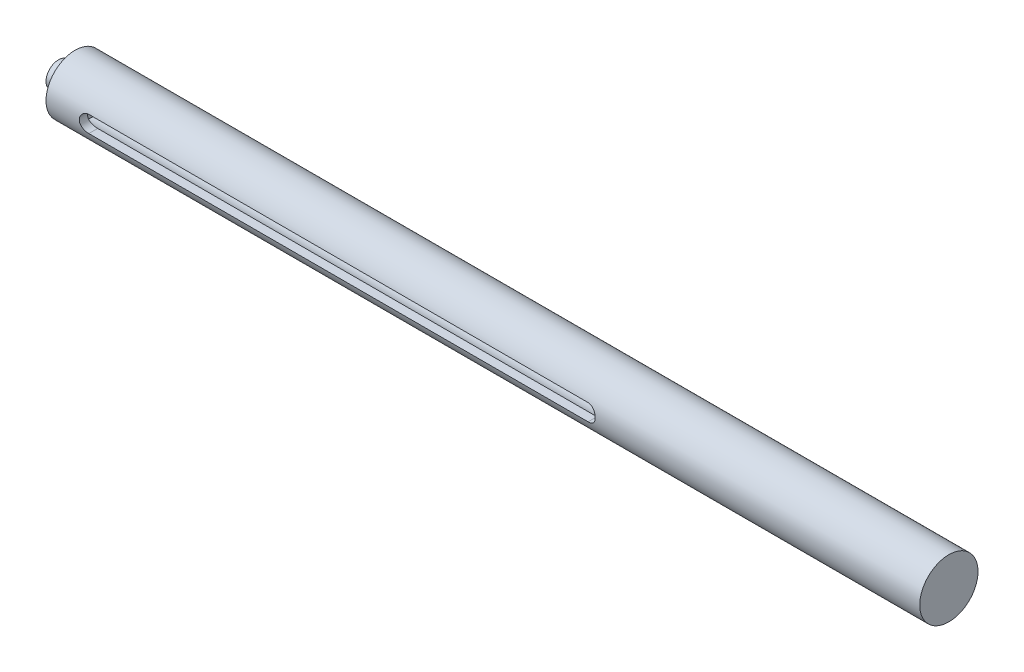
ISO-10303-21;
HEADER;
FILE_DESCRIPTION(('STEP AP214'),'2;1');
FILE_NAME('part.step','',(''),(''),'','','');
FILE_SCHEMA(('AUTOMOTIVE_DESIGN { 1 0 10303 214 1 1 1 1 }'));
ENDSEC;
DATA;
#1=APPLICATION_CONTEXT('core data for automotive mechanical design processes');
#2=APPLICATION_PROTOCOL_DEFINITION('international standard','automotive_design',2000,#1);
#3=PRODUCT_CONTEXT('',#1,'mechanical');
#4=PRODUCT('Part','Part','',(#3));
#5=PRODUCT_RELATED_PRODUCT_CATEGORY('part','',(#4));
#6=PRODUCT_DEFINITION_FORMATION('','',#4);
#7=PRODUCT_DEFINITION_CONTEXT('part definition',#1,'design');
#8=PRODUCT_DEFINITION('design','',#6,#7);
#9=PRODUCT_DEFINITION_SHAPE('','',#8);
#10=(LENGTH_UNIT() NAMED_UNIT(*) SI_UNIT(.MILLI.,.METRE.));
#11=(NAMED_UNIT(*) PLANE_ANGLE_UNIT() SI_UNIT($,.RADIAN.));
#12=(NAMED_UNIT(*) SI_UNIT($,.STERADIAN.) SOLID_ANGLE_UNIT());
#13=UNCERTAINTY_MEASURE_WITH_UNIT(LENGTH_MEASURE(1.E-05),#10,'distance_accuracy_value','');
#14=(GEOMETRIC_REPRESENTATION_CONTEXT(3) GLOBAL_UNCERTAINTY_ASSIGNED_CONTEXT((#13)) GLOBAL_UNIT_ASSIGNED_CONTEXT((#10,
#11,#12)) REPRESENTATION_CONTEXT('',''));
#15=CARTESIAN_POINT('',(0.,0.,0.));
#16=DIRECTION('',(0.,0.,1.));
#17=DIRECTION('',(1.,0.,0.));
#18=AXIS2_PLACEMENT_3D('',#15,#16,#17);
#19=CARTESIAN_POINT('',(-40.,0.,0.));
#20=DIRECTION('',(1.,0.,0.));
#21=DIRECTION('',(0.,0.,-1.));
#22=AXIS2_PLACEMENT_3D('',#19,#20,#21);
#23=PLANE('',#22);
#24=CARTESIAN_POINT('',(-40.,0.,0.));
#25=DIRECTION('',(1.,0.,0.));
#26=DIRECTION('',(0.,0.,-1.));
#27=AXIS2_PLACEMENT_3D('',#24,#25,#26);
#28=CIRCLE('',#27,3.5);
#29=CARTESIAN_POINT('',(-40.,0.,-3.5));
#30=VERTEX_POINT('',#29);
#31=EDGE_CURVE('E87',#30,#30,#28,.T.);
#32=ORIENTED_EDGE('',*,*,#31,.F.);
#33=EDGE_LOOP('',(#32));
#34=FACE_BOUND('',#33,.T.);
#35=CARTESIAN_POINT('',(-40.,0.,0.));
#36=DIRECTION('',(1.,0.,0.));
#37=DIRECTION('',(0.,0.,-1.));
#38=AXIS2_PLACEMENT_3D('',#35,#36,#37);
#39=CIRCLE('',#38,1.5);
#40=CARTESIAN_POINT('',(-40.,0.,-1.5));
#41=VERTEX_POINT('',#40);
#42=EDGE_CURVE('E27',#41,#41,#39,.F.);
#43=ORIENTED_EDGE('',*,*,#42,.F.);
#44=EDGE_LOOP('',(#43));
#45=FACE_BOUND('',#44,.T.);
#46=ADVANCED_FACE('F18',(#34,#45),#23,.F.);
#47=CARTESIAN_POINT('',(40.,0.,0.));
#48=DIRECTION('',(-1.,0.,0.));
#49=DIRECTION('',(0.,0.,1.));
#50=AXIS2_PLACEMENT_3D('',#47,#48,#49);
#51=CYLINDRICAL_SURFACE('',#50,3.5);
#52=ORIENTED_EDGE('',*,*,#31,.T.);
#53=EDGE_LOOP('',(#52));
#54=FACE_BOUND('',#53,.T.);
#55=CARTESIAN_POINT('',(25.,-1.,3.35410196624968));
#56=CARTESIAN_POINT('',(25.0275170249075,-1.00000049850503,3.35409976658492));
#57=CARTESIAN_POINT('',(25.0550202597348,-0.998863493287081,3.35444102034788));
#58=CARTESIAN_POINT('',(25.1098181033841,-0.994332009888001,3.35578786459359));
#59=CARTESIAN_POINT('',(25.1371127542802,-0.990937999820865,3.3567933173179));
#60=CARTESIAN_POINT('',(25.2182537496955,-0.977425314705552,3.36076375039943));
#61=CARTESIAN_POINT('',(25.2715378170372,-0.963975716618306,3.36468309657148));
#62=CARTESIAN_POINT('',(25.3749700144545,-0.928648815906224,3.37460265056326));
#63=CARTESIAN_POINT('',(25.4251189911293,-0.906773800005599,3.38060229373009));
#64=CARTESIAN_POINT('',(25.5210683200399,-0.855250482454159,3.39400252324997));
#65=CARTESIAN_POINT('',(25.5668668974157,-0.825599026596321,3.40140367773159));
#66=CARTESIAN_POINT('',(25.6540953815059,-0.758463189713919,3.41700871116802));
#67=CARTESIAN_POINT('',(25.6953820675198,-0.72079643428964,3.42522837538694));
#68=CARTESIAN_POINT('',(25.7711495263556,-0.639087782954267,3.44140944203543));
#69=CARTESIAN_POINT('',(25.8056291705064,-0.595044831905348,3.44937080145308));
#70=CARTESIAN_POINT('',(25.8674150706982,-0.500821950623903,3.46431682750159));
#71=CARTESIAN_POINT('',(25.8945760360545,-0.450543143150311,3.47128058280447));
#72=CARTESIAN_POINT('',(25.940001691248,-0.345901809951461,3.48326292773679));
#73=CARTESIAN_POINT('',(25.9582685086114,-0.291540264432993,3.48828198248995));
#74=CARTESIAN_POINT('',(25.9849170938375,-0.18177986422046,3.49569755735467));
#75=CARTESIAN_POINT('',(25.9935443291132,-0.126445076386653,3.49815908311015));
#76=CARTESIAN_POINT('',(26.0014433806286,-0.0150612429205636,3.50041048233729));
#77=CARTESIAN_POINT('',(26.0007167870587,0.0409876796872728,3.50020080992396));
#78=CARTESIAN_POINT('',(25.9900967865968,0.150490378802964,3.49718002611497));
#79=CARTESIAN_POINT('',(25.9804690968915,0.203972329131895,3.4944443251868));
#80=CARTESIAN_POINT('',(25.9527522573653,0.308526642102498,3.48676938053403));
#81=CARTESIAN_POINT('',(25.9346626803645,0.359598882951953,3.48183002556336));
#82=CARTESIAN_POINT('',(25.8903451327296,0.458537318553558,3.47019511125505));
#83=CARTESIAN_POINT('',(25.8640302352287,0.506362294335579,3.46348091788377));
#84=CARTESIAN_POINT('',(25.8040771088532,0.597004321590961,3.44901371958343));
#85=CARTESIAN_POINT('',(25.770437393581,0.639820353903323,3.44126050393247));
#86=CARTESIAN_POINT('',(25.695401201975,0.720812145758809,3.42522923719649));
#87=CARTESIAN_POINT('',(25.6537744565459,0.758773058684968,3.41694231453104));
#88=CARTESIAN_POINT('',(25.5646513518634,0.827240355260741,3.40101643089073));
#89=CARTESIAN_POINT('',(25.5171533336562,0.857744624720446,3.39337765408524));
#90=CARTESIAN_POINT('',(25.4171063869067,0.910632887034017,3.37957156162494));
#91=CARTESIAN_POINT('',(25.3645179481512,0.932945634858352,3.37341730876614));
#92=CARTESIAN_POINT('',(25.2561439679439,0.968311532076212,3.36343812734786));
#93=CARTESIAN_POINT('',(25.2003634116952,0.981378715751668,3.3596096696078));
#94=CARTESIAN_POINT('',(25.1200602690921,0.993060108315531,3.35616467475823));
#95=CARTESIAN_POINT('',(25.0961103225751,0.995662513879,3.35539270208153));
#96=CARTESIAN_POINT('',(25.0481108873562,0.999130770524189,3.35436137521794));
#97=CARTESIAN_POINT('',(25.0240616067922,0.999999270178643,3.35410123920007));
#98=CARTESIAN_POINT('',(25.,1.,3.35410196624968));
#99=B_SPLINE_CURVE_WITH_KNOTS('',3,(#55,#56,#57,#58,#59,#60,#61,#62,#63,#64,#65,#66,#67,#68,#69,
#70,#71,#72,#73,#74,#75,#76,#77,#78,#79,#80,#81,#82,#83,#84,#85,#86,#87,#88,#89,#90,#91,#92,#93,
#94,#95,#96,#97,#98),.UNSPECIFIED.,.F.,.F.,(4,2,2,2,2,2,2,2,2,2,2,2,2,2,2,2,2,2,2,2,2,4),(0.,
0.0824984357609059,0.164979766271595,0.329407523681618,0.493790685524924,0.658240626330376,
0.826933952896786,0.995655226942842,1.16751346138032,1.33933056621707,1.50666495361948,
1.67397089384628,1.83643825095359,1.99891381075498,2.16316806750177,2.32745568686297,
2.49749310251654,2.6675786732818,2.83911034045408,3.01038106966817,3.08263487199162,
3.15477822061624),.UNSPECIFIED.);
#100=CARTESIAN_POINT('',(25.,-1.,3.35410196624968));
#101=VERTEX_POINT('',#100);
#102=CARTESIAN_POINT('',(25.,1.,3.35410196624968));
#103=VERTEX_POINT('',#102);
#104=EDGE_CURVE('E90',#101,#103,#99,.T.);
#105=ORIENTED_EDGE('',*,*,#104,.F.);
#106=DIRECTION('',(-1.,0.,0.));
#107=VECTOR('',#106,1.);
#108=CARTESIAN_POINT('',(40.,-1.,3.35410196624968));
#109=LINE('',#108,#107);
#110=CARTESIAN_POINT('',(-35.,-1.,3.35410196624968));
#111=VERTEX_POINT('',#110);
#112=EDGE_CURVE('E152',#111,#101,#109,.F.);
#113=ORIENTED_EDGE('',*,*,#112,.F.);
#114=CARTESIAN_POINT('',(-35.,1.,3.35410196624968));
#115=CARTESIAN_POINT('',(-35.0275170249075,1.00000049850503,3.35409976658492));
#116=CARTESIAN_POINT('',(-35.0550202597348,0.998863493287082,3.35444102034788));
#117=CARTESIAN_POINT('',(-35.1098181033841,0.994332009888001,3.35578786459359));
#118=CARTESIAN_POINT('',(-35.1371127542802,0.990937999820865,3.3567933173179));
#119=CARTESIAN_POINT('',(-35.2182537496955,0.977425314705554,3.36076375039943));
#120=CARTESIAN_POINT('',(-35.2715378170372,0.963975716618308,3.36468309657148));
#121=CARTESIAN_POINT('',(-35.3749700144545,0.928648815906219,3.37460265056326));
#122=CARTESIAN_POINT('',(-35.4251189911293,0.906773800005585,3.38060229373009));
#123=CARTESIAN_POINT('',(-35.52106832004,0.855250482454147,3.39400252324997));
#124=CARTESIAN_POINT('',(-35.5668668974158,0.825599026596321,3.40140367773159));
#125=CARTESIAN_POINT('',(-35.6540953815059,0.75846318971392,3.41700871116802));
#126=CARTESIAN_POINT('',(-35.6953820675198,0.720796434289633,3.42522837538694));
#127=CARTESIAN_POINT('',(-35.7711495263556,0.639087782954258,3.44140944203543));
#128=CARTESIAN_POINT('',(-35.8056291705064,0.595044831905346,3.44937080145308));
#129=CARTESIAN_POINT('',(-35.8674150706982,0.500821950623907,3.46431682750159));
#130=CARTESIAN_POINT('',(-35.8945760360545,0.450543143150314,3.47128058280446));
#131=CARTESIAN_POINT('',(-35.940001691248,0.345901809951462,3.48326292773679));
#132=CARTESIAN_POINT('',(-35.9582685086114,0.291540264432993,3.48828198248995));
#133=CARTESIAN_POINT('',(-35.9849170938375,0.181779864220459,3.49569755735467));
#134=CARTESIAN_POINT('',(-35.9935443291132,0.126445076386652,3.49815908311015));
#135=CARTESIAN_POINT('',(-36.0014433806286,0.0150612429205627,3.50041048233729));
#136=CARTESIAN_POINT('',(-36.0007167870587,-0.0409876796872739,3.50020080992396));
#137=CARTESIAN_POINT('',(-35.9900967865968,-0.150490378802965,3.49718002611497));
#138=CARTESIAN_POINT('',(-35.9804690968915,-0.203972329131895,3.4944443251868));
#139=CARTESIAN_POINT('',(-35.9527522573653,-0.308526642102499,3.48676938053403));
#140=CARTESIAN_POINT('',(-35.9346626803645,-0.359598882951955,3.48183002556336));
#141=CARTESIAN_POINT('',(-35.8903451327296,-0.458537318553552,3.47019511125505));
#142=CARTESIAN_POINT('',(-35.8640302352286,-0.506362294335566,3.46348091788377));
#143=CARTESIAN_POINT('',(-35.8040771088533,-0.597004321590951,3.44901371958344));
#144=CARTESIAN_POINT('',(-35.7704373935811,-0.639820353903326,3.44126050393247));
#145=CARTESIAN_POINT('',(-35.695401201975,-0.720812145758812,3.42522923719649));
#146=CARTESIAN_POINT('',(-35.6537744565459,-0.758773058684957,3.41694231453104));
#147=CARTESIAN_POINT('',(-35.5646513518634,-0.827240355260727,3.40101643089074));
#148=CARTESIAN_POINT('',(-35.5171533336562,-0.857744624720442,3.39337765408524));
#149=CARTESIAN_POINT('',(-35.4171063869067,-0.910632887034021,3.37957156162494));
#150=CARTESIAN_POINT('',(-35.3645179481512,-0.932945634858353,3.37341730876614));
#151=CARTESIAN_POINT('',(-35.2561439679439,-0.968311532076213,3.36343812734786));
#152=CARTESIAN_POINT('',(-35.2003634116952,-0.981378715751669,3.3596096696078));
#153=CARTESIAN_POINT('',(-35.1200602690921,-0.993060108315532,3.35616467475823));
#154=CARTESIAN_POINT('',(-35.0961103225751,-0.995662513879001,3.35539270208153));
#155=CARTESIAN_POINT('',(-35.0481108873562,-0.999130770524188,3.35436137521794));
#156=CARTESIAN_POINT('',(-35.0240616067922,-0.999999270178643,3.35410123920007));
#157=CARTESIAN_POINT('',(-35.,-1.,3.35410196624968));
#158=B_SPLINE_CURVE_WITH_KNOTS('',3,(#114,#115,#116,#117,#118,#119,#120,#121,#122,#123,#124,
#125,#126,#127,#128,#129,#130,#131,#132,#133,#134,#135,#136,#137,#138,#139,#140,#141,#142,#143,
#144,#145,#146,#147,#148,#149,#150,#151,#152,#153,#154,#155,#156,#157),.UNSPECIFIED.,.F.,.F.,(4,
2,2,2,2,2,2,2,2,2,2,2,2,2,2,2,2,2,2,2,2,4),(0.,0.0824984357609093,0.164979766271588,
0.329407523681618,0.493790685524952,0.658240626330415,0.826933952896799,0.99565522694284,
1.16751346138032,1.33933056621707,1.50666495361948,1.67397089384628,1.8364382509536,
1.99891381075499,2.16316806750176,2.32745568686294,2.49749310251653,2.66757867328181,
2.83911034045409,3.01038106966818,3.08263487199164,3.15477822061625),.UNSPECIFIED.);
#159=CARTESIAN_POINT('',(-35.,1.,3.35410196624968));
#160=VERTEX_POINT('',#159);
#161=EDGE_CURVE('E97',#160,#111,#158,.T.);
#162=ORIENTED_EDGE('',*,*,#161,.F.);
#163=DIRECTION('',(-1.,0.,0.));
#164=VECTOR('',#163,1.);
#165=CARTESIAN_POINT('',(40.,1.,3.35410196624968));
#166=LINE('',#165,#164);
#167=EDGE_CURVE('E75',#103,#160,#166,.T.);
#168=ORIENTED_EDGE('',*,*,#167,.F.);
#169=EDGE_LOOP('',(#105,#113,#162,#168));
#170=FACE_BOUND('',#169,.T.);
#171=CARTESIAN_POINT('',(65.,0.,0.));
#172=DIRECTION('',(1.,0.,0.));
#173=DIRECTION('',(0.,0.,-1.));
#174=AXIS2_PLACEMENT_3D('',#171,#172,#173);
#175=CIRCLE('',#174,3.5);
#176=CARTESIAN_POINT('',(65.,0.,-3.5));
#177=VERTEX_POINT('',#176);
#178=EDGE_CURVE('E70',#177,#177,#175,.T.);
#179=ORIENTED_EDGE('',*,*,#178,.F.);
#180=EDGE_LOOP('',(#179));
#181=FACE_BOUND('',#180,.T.);
#182=ADVANCED_FACE('F20',(#54,#170,#181),#51,.T.);
#183=CARTESIAN_POINT('',(-35.,0.,3.5));
#184=DIRECTION('',(0.,0.,-1.));
#185=DIRECTION('',(-1.,0.,0.));
#186=AXIS2_PLACEMENT_3D('',#183,#184,#185);
#187=CYLINDRICAL_SURFACE('',#186,1.);
#188=CARTESIAN_POINT('',(-35.,1.,2.29128784747792));
#189=CARTESIAN_POINT('',(-35.0269103840027,1.00000116386643,2.29128430939571));
#190=CARTESIAN_POINT('',(-35.0538065609444,0.998913043941582,2.29176252371932));
#191=CARTESIAN_POINT('',(-35.1073819223814,0.994580942217761,2.29364713413326));
#192=CARTESIAN_POINT('',(-35.1340611856053,0.991337781507211,2.29505317671192));
#193=CARTESIAN_POINT('',(-35.2132675610055,0.978449878798021,2.30059288924686));
#194=CARTESIAN_POINT('',(-35.2652248346111,0.965646201662909,2.30604882507105));
#195=CARTESIAN_POINT('',(-35.3660084567948,0.932127367996509,2.31979763689074));
#196=CARTESIAN_POINT('',(-35.4148379987117,0.91142043585267,2.32808756281048));
#197=CARTESIAN_POINT('',(-35.5083868962999,0.862742971325663,2.34656153650137));
#198=CARTESIAN_POINT('',(-35.5531022895601,0.834765533722777,2.35674738231355));
#199=CARTESIAN_POINT('',(-35.639634338551,0.770658598314694,2.37850508848236));
#200=CARTESIAN_POINT('',(-35.6811844510361,0.734184414240038,2.39012125272111));
#201=CARTESIAN_POINT('',(-35.7577692933566,0.654848386636597,2.41306392819471));
#202=CARTESIAN_POINT('',(-35.792802685594,0.611985234976875,2.42439037955359));
#203=CARTESIAN_POINT('',(-35.856703436018,0.519002909887977,2.44601709248996));
#204=CARTESIAN_POINT('',(-35.8852724685305,0.468663954715679,2.45625912457899));
#205=CARTESIAN_POINT('',(-35.9334219724715,0.363412083428239,2.47401971876446));
#206=CARTESIAN_POINT('',(-35.9530061953086,0.30850108760279,2.48153941723396));
#207=CARTESIAN_POINT('',(-35.9816706165632,0.19848371770778,2.49269157373246));
#208=CARTESIAN_POINT('',(-35.9912134797064,0.143515526475389,2.49649461286354));
#209=CARTESIAN_POINT('',(-36.0010142357207,0.0326342160141269,2.50040155088157));
#210=CARTESIAN_POINT('',(-36.001275417903,-0.0232785614371597,2.50050676023285));
#211=CARTESIAN_POINT('',(-35.9927585814665,-0.1311166883068,2.49710980025699));
#212=CARTESIAN_POINT('',(-35.9844874769435,-0.183089601305246,2.49380992793548));
#213=CARTESIAN_POINT('',(-35.9600032861927,-0.284837393198609,2.48424635219906));
#214=CARTESIAN_POINT('',(-35.94378975049,-0.334612147522428,2.47798248104744));
#215=CARTESIAN_POINT('',(-35.9036818518646,-0.431448769549348,2.46298415299617));
#216=CARTESIAN_POINT('',(-35.8796753796154,-0.478458425687026,2.45421387377984));
#217=CARTESIAN_POINT('',(-35.8247677056818,-0.567903734595059,2.43507301003961));
#218=CARTESIAN_POINT('',(-35.793864085149,-0.610337774922437,2.42470186448207));
#219=CARTESIAN_POINT('',(-35.7236779098768,-0.692381696369259,2.40260891373089));
#220=CARTESIAN_POINT('',(-35.6839787626666,-0.731623851544995,2.39084313586447));
#221=CARTESIAN_POINT('',(-35.5985099524245,-0.803049630497082,2.3678097529232));
#222=CARTESIAN_POINT('',(-35.5527375389524,-0.835230038544943,2.3565423766639));
#223=CARTESIAN_POINT('',(-35.4547648579898,-0.89246828966811,2.33547844428013));
#224=CARTESIAN_POINT('',(-35.40241758167,-0.917294661088132,2.32573351075292));
#225=CARTESIAN_POINT('',(-35.2938192377852,-0.957606491786299,2.30943052529791));
#226=CARTESIAN_POINT('',(-35.2375752763308,-0.973108480011036,2.30286683814369));
#227=CARTESIAN_POINT('',(-35.150628182921,-0.989052909128603,2.29604151764747));
#228=CARTESIAN_POINT('',(-35.1206712253493,-0.993152525829897,2.29426718840263));
#229=CARTESIAN_POINT('',(-35.0604824905022,-0.998626410519056,2.29188770157194));
#230=CARTESIAN_POINT('',(-35.0302508941211,-1.00000235784284,2.29128182355872));
#231=CARTESIAN_POINT('',(-35.,-1.,2.29128784747792));
#232=B_SPLINE_CURVE_WITH_KNOTS('',3,(#188,#189,#190,#191,#192,#193,#194,#195,#196,#197,#198,
#199,#200,#201,#202,#203,#204,#205,#206,#207,#208,#209,#210,#211,#212,#213,#214,#215,#216,#217,
#218,#219,#220,#221,#222,#223,#224,#225,#226,#227,#228,#229,#230,#231),.UNSPECIFIED.,.F.,.F.,(4,
2,2,2,2,2,2,2,2,2,2,2,2,2,2,2,2,2,2,2,2,4),(0.,0.0806774265494227,0.161324131941622,
0.32184353760246,0.482196354925837,0.64270202876941,0.811445094033768,0.98022275675223,
1.15566914868509,1.33104222004289,1.49792423657763,1.66474711162956,1.82219943035396,
1.97966066058455,2.13949573869401,2.29938695972136,2.46976422743204,2.64021892007596,
2.81557606179859,2.99062143201691,3.08135581684535,3.17203424002409),.UNSPECIFIED.);
#233=CARTESIAN_POINT('',(-35.,1.,2.29128784747792));
#234=VERTEX_POINT('',#233);
#235=CARTESIAN_POINT('',(-35.,-1.,2.29128784747792));
#236=VERTEX_POINT('',#235);
#237=EDGE_CURVE('E60',#234,#236,#232,.T.);
#238=ORIENTED_EDGE('',*,*,#237,.F.);
#239=DIRECTION('',(0.,0.,-1.));
#240=VECTOR('',#239,1.);
#241=CARTESIAN_POINT('',(-35.,1.,3.5));
#242=LINE('',#241,#240);
#243=EDGE_CURVE('E67',#160,#234,#242,.T.);
#244=ORIENTED_EDGE('',*,*,#243,.F.);
#245=ORIENTED_EDGE('',*,*,#161,.T.);
#246=DIRECTION('',(0.,0.,-1.));
#247=VECTOR('',#246,1.);
#248=CARTESIAN_POINT('',(-35.,-1.,3.5));
#249=LINE('',#248,#247);
#250=EDGE_CURVE('E69',#111,#236,#249,.T.);
#251=ORIENTED_EDGE('',*,*,#250,.T.);
#252=EDGE_LOOP('',(#238,#244,#245,#251));
#253=FACE_BOUND('',#252,.T.);
#254=ADVANCED_FACE('F66',(#253),#187,.F.);
#255=CARTESIAN_POINT('',(-35.,-1.,3.5));
#256=DIRECTION('',(0.,1.,0.));
#257=DIRECTION('',(-1.,0.,0.));
#258=AXIS2_PLACEMENT_3D('',#255,#256,#257);
#259=PLANE('',#258);
#260=DIRECTION('',(1.,0.,0.));
#261=VECTOR('',#260,1.);
#262=CARTESIAN_POINT('',(-47.0710678118655,-1.,2.29128784747792));
#263=LINE('',#262,#261);
#264=CARTESIAN_POINT('',(25.,-1.,2.29128784747792));
#265=VERTEX_POINT('',#264);
#266=EDGE_CURVE('E71',#236,#265,#263,.T.);
#267=ORIENTED_EDGE('',*,*,#266,.F.);
#268=ORIENTED_EDGE('',*,*,#250,.F.);
#269=ORIENTED_EDGE('',*,*,#112,.T.);
#270=DIRECTION('',(0.,0.,-1.));
#271=VECTOR('',#270,1.);
#272=CARTESIAN_POINT('',(25.,-1.,3.5));
#273=LINE('',#272,#271);
#274=EDGE_CURVE('E78',#101,#265,#273,.T.);
#275=ORIENTED_EDGE('',*,*,#274,.T.);
#276=EDGE_LOOP('',(#267,#268,#269,#275));
#277=FACE_BOUND('',#276,.T.);
#278=ADVANCED_FACE('F109',(#277),#259,.T.);
#279=CARTESIAN_POINT('',(25.,0.,3.5));
#280=DIRECTION('',(0.,0.,-1.));
#281=DIRECTION('',(-1.,0.,0.));
#282=AXIS2_PLACEMENT_3D('',#279,#280,#281);
#283=CYLINDRICAL_SURFACE('',#282,1.);
#284=CARTESIAN_POINT('',(25.,-1.,2.29128784747792));
#285=CARTESIAN_POINT('',(25.0269103840027,-1.00000116386643,2.29128430939571));
#286=CARTESIAN_POINT('',(25.0538065609444,-0.998913043941582,2.29176252371932));
#287=CARTESIAN_POINT('',(25.1073819223814,-0.994580942217764,2.29364713413326));
#288=CARTESIAN_POINT('',(25.1340611856052,-0.991337781507216,2.29505317671192));
#289=CARTESIAN_POINT('',(25.2132675610054,-0.978449878798026,2.30059288924686));
#290=CARTESIAN_POINT('',(25.2652248346111,-0.965646201662906,2.30604882507105));
#291=CARTESIAN_POINT('',(25.3660084567947,-0.932127367996508,2.31979763689074));
#292=CARTESIAN_POINT('',(25.4148379987117,-0.911420435852677,2.32808756281048));
#293=CARTESIAN_POINT('',(25.5083868962999,-0.862742971325673,2.34656153650137));
#294=CARTESIAN_POINT('',(25.5531022895601,-0.834765533722784,2.35674738231355));
#295=CARTESIAN_POINT('',(25.639634338551,-0.770658598314696,2.37850508848236));
#296=CARTESIAN_POINT('',(25.6811844510361,-0.73418441424004,2.39012125272111));
#297=CARTESIAN_POINT('',(25.7577692933566,-0.654848386636598,2.41306392819471));
#298=CARTESIAN_POINT('',(25.792802685594,-0.611985234976875,2.42439037955359));
#299=CARTESIAN_POINT('',(25.856703436018,-0.519002909887977,2.44601709248996));
#300=CARTESIAN_POINT('',(25.8852724685305,-0.468663954715677,2.45625912457899));
#301=CARTESIAN_POINT('',(25.9334219724715,-0.363412083428237,2.47401971876446));
#302=CARTESIAN_POINT('',(25.9530061953086,-0.308501087602788,2.48153941723396));
#303=CARTESIAN_POINT('',(25.9816706165632,-0.198483717707779,2.49269157373246));
#304=CARTESIAN_POINT('',(25.9912134797064,-0.143515526475389,2.49649461286354));
#305=CARTESIAN_POINT('',(26.0010142357207,-0.0326342160141267,2.50040155088157));
#306=CARTESIAN_POINT('',(26.001275417903,0.0232785614371597,2.50050676023285));
#307=CARTESIAN_POINT('',(25.9927585814666,0.1311166883068,2.49710980025699));
#308=CARTESIAN_POINT('',(25.9844874769436,0.183089601305246,2.49380992793548));
#309=CARTESIAN_POINT('',(25.9600032861927,0.284837393198608,2.48424635219906));
#310=CARTESIAN_POINT('',(25.94378975049,0.334612147522426,2.47798248104744));
#311=CARTESIAN_POINT('',(25.9036818518646,0.431448769549353,2.46298415299616));
#312=CARTESIAN_POINT('',(25.8796753796154,0.478458425687039,2.45421387377984));
#313=CARTESIAN_POINT('',(25.8247677056818,0.567903734595067,2.43507301003961));
#314=CARTESIAN_POINT('',(25.793864085149,0.610337774922431,2.42470186448208));
#315=CARTESIAN_POINT('',(25.7236779098768,0.692381696369253,2.40260891373089));
#316=CARTESIAN_POINT('',(25.6839787626666,0.731623851545005,2.39084313586447));
#317=CARTESIAN_POINT('',(25.5985099524245,0.803049630497096,2.3678097529232));
#318=CARTESIAN_POINT('',(25.5527375389524,0.835230038544947,2.3565423766639));
#319=CARTESIAN_POINT('',(25.4547648579898,0.892468289668106,2.33547844428014));
#320=CARTESIAN_POINT('',(25.40241758167,0.917294661088129,2.32573351075292));
#321=CARTESIAN_POINT('',(25.2938192377852,0.957606491786299,2.30943052529791));
#322=CARTESIAN_POINT('',(25.2375752763308,0.973108480011036,2.30286683814369));
#323=CARTESIAN_POINT('',(25.150628182921,0.989052909128603,2.29604151764747));
#324=CARTESIAN_POINT('',(25.1206712253493,0.993152525829897,2.29426718840263));
#325=CARTESIAN_POINT('',(25.0604824905022,0.998626410519057,2.29188770157194));
#326=CARTESIAN_POINT('',(25.0302508941211,1.00000235784284,2.29128182355872));
#327=CARTESIAN_POINT('',(25.,1.,2.29128784747792));
#328=B_SPLINE_CURVE_WITH_KNOTS('',3,(#284,#285,#286,#287,#288,#289,#290,#291,#292,#293,#294,
#295,#296,#297,#298,#299,#300,#301,#302,#303,#304,#305,#306,#307,#308,#309,#310,#311,#312,#313,
#314,#315,#316,#317,#318,#319,#320,#321,#322,#323,#324,#325,#326,#327),.UNSPECIFIED.,.F.,.F.,(4,
2,2,2,2,2,2,2,2,2,2,2,2,2,2,2,2,2,2,2,2,4),(0.,0.0806774265494018,0.161324131941586,
0.321843537602416,0.482196354925818,0.642702028769406,0.811445094033764,0.980222756752228,
1.1556691486851,1.33104222004289,1.49792423657763,1.66474711162956,1.82219943035396,
1.97966066058455,2.13949573869402,2.29938695972139,2.46976422743206,2.64021892007595,
2.81557606179858,2.9906214320169,3.08135581684534,3.17203424002408),.UNSPECIFIED.);
#329=CARTESIAN_POINT('',(25.,1.,2.29128784747792));
#330=VERTEX_POINT('',#329);
#331=EDGE_CURVE('E33',#265,#330,#328,.T.);
#332=ORIENTED_EDGE('',*,*,#331,.F.);
#333=ORIENTED_EDGE('',*,*,#274,.F.);
#334=ORIENTED_EDGE('',*,*,#104,.T.);
#335=DIRECTION('',(0.,0.,-1.));
#336=VECTOR('',#335,1.);
#337=CARTESIAN_POINT('',(25.,1.,3.5));
#338=LINE('',#337,#336);
#339=EDGE_CURVE('E40',#103,#330,#338,.T.);
#340=ORIENTED_EDGE('',*,*,#339,.T.);
#341=EDGE_LOOP('',(#332,#333,#334,#340));
#342=FACE_BOUND('',#341,.T.);
#343=ADVANCED_FACE('F104',(#342),#283,.F.);
#344=CARTESIAN_POINT('',(-35.,1.,3.5));
#345=DIRECTION('',(0.,-1.,0.));
#346=DIRECTION('',(0.,0.,-1.));
#347=AXIS2_PLACEMENT_3D('',#344,#345,#346);
#348=PLANE('',#347);
#349=DIRECTION('',(1.,0.,0.));
#350=VECTOR('',#349,1.);
#351=CARTESIAN_POINT('',(-47.0710678118655,1.,2.29128784747792));
#352=LINE('',#351,#350);
#353=EDGE_CURVE('E12',#330,#234,#352,.F.);
#354=ORIENTED_EDGE('',*,*,#353,.F.);
#355=ORIENTED_EDGE('',*,*,#339,.F.);
#356=ORIENTED_EDGE('',*,*,#167,.T.);
#357=ORIENTED_EDGE('',*,*,#243,.T.);
#358=EDGE_LOOP('',(#354,#355,#356,#357));
#359=FACE_BOUND('',#358,.T.);
#360=ADVANCED_FACE('F73',(#359),#348,.T.);
#361=CARTESIAN_POINT('',(-42.,0.,0.));
#362=DIRECTION('',(1.,0.,0.));
#363=DIRECTION('',(0.,0.,-1.));
#364=AXIS2_PLACEMENT_3D('',#361,#362,#363);
#365=CYLINDRICAL_SURFACE('',#364,1.5);
#366=CARTESIAN_POINT('',(-42.,0.,0.));
#367=DIRECTION('',(-1.,0.,0.));
#368=DIRECTION('',(0.,0.,1.));
#369=AXIS2_PLACEMENT_3D('',#366,#367,#368);
#370=CIRCLE('',#369,1.5);
#371=CARTESIAN_POINT('',(-42.,0.,1.5));
#372=VERTEX_POINT('',#371);
#373=EDGE_CURVE('E76',#372,#372,#370,.T.);
#374=ORIENTED_EDGE('',*,*,#373,.F.);
#375=EDGE_LOOP('',(#374));
#376=FACE_BOUND('',#375,.T.);
#377=ORIENTED_EDGE('',*,*,#42,.T.);
#378=EDGE_LOOP('',(#377));
#379=FACE_BOUND('',#378,.T.);
#380=ADVANCED_FACE('F169',(#376,#379),#365,.T.);
#381=CARTESIAN_POINT('',(-42.,0.,0.));
#382=DIRECTION('',(-1.,0.,0.));
#383=DIRECTION('',(0.,0.,1.));
#384=AXIS2_PLACEMENT_3D('',#381,#382,#383);
#385=PLANE('',#384);
#386=ORIENTED_EDGE('',*,*,#373,.T.);
#387=EDGE_LOOP('',(#386));
#388=FACE_BOUND('',#387,.T.);
#389=ADVANCED_FACE('F164',(#388),#385,.T.);
#390=CARTESIAN_POINT('',(65.,0.,0.));
#391=DIRECTION('',(1.,0.,0.));
#392=DIRECTION('',(0.,0.,-1.));
#393=AXIS2_PLACEMENT_3D('',#390,#391,#392);
#394=PLANE('',#393);
#395=ORIENTED_EDGE('',*,*,#178,.T.);
#396=EDGE_LOOP('',(#395));
#397=FACE_BOUND('',#396,.T.);
#398=ADVANCED_FACE('F128',(#397),#394,.T.);
#399=CARTESIAN_POINT('',(-47.0710678118655,0.,0.));
#400=DIRECTION('',(1.,0.,0.));
#401=DIRECTION('',(0.,0.,-1.));
#402=AXIS2_PLACEMENT_3D('',#399,#400,#401);
#403=CYLINDRICAL_SURFACE('',#402,2.5);
#404=ORIENTED_EDGE('',*,*,#237,.T.);
#405=ORIENTED_EDGE('',*,*,#266,.T.);
#406=ORIENTED_EDGE('',*,*,#331,.T.);
#407=ORIENTED_EDGE('',*,*,#353,.T.);
#408=EDGE_LOOP('',(#404,#405,#406,#407));
#409=FACE_BOUND('',#408,.T.);
#410=CARTESIAN_POINT('',(-38.,0.,0.));
#411=DIRECTION('',(1.,0.,0.));
#412=DIRECTION('',(0.,0.,-1.));
#413=AXIS2_PLACEMENT_3D('',#410,#411,#412);
#414=CIRCLE('',#413,2.5);
#415=CARTESIAN_POINT('',(-38.,0.,-2.5));
#416=VERTEX_POINT('',#415);
#417=EDGE_CURVE('E121',#416,#416,#414,.F.);
#418=ORIENTED_EDGE('',*,*,#417,.T.);
#419=EDGE_LOOP('',(#418));
#420=FACE_BOUND('',#419,.T.);
#421=CARTESIAN_POINT('',(63.,0.,0.));
#422=DIRECTION('',(1.,0.,0.));
#423=DIRECTION('',(0.,0.,-1.));
#424=AXIS2_PLACEMENT_3D('',#421,#422,#423);
#425=CIRCLE('',#424,2.5);
#426=CARTESIAN_POINT('',(63.,0.,-2.5));
#427=VERTEX_POINT('',#426);
#428=EDGE_CURVE('E255',#427,#427,#425,.T.);
#429=ORIENTED_EDGE('',*,*,#428,.T.);
#430=EDGE_LOOP('',(#429));
#431=FACE_BOUND('',#430,.T.);
#432=ADVANCED_FACE('F58',(#409,#420,#431),#403,.F.);
#433=CARTESIAN_POINT('',(-38.,0.,0.));
#434=DIRECTION('',(1.,0.,0.));
#435=DIRECTION('',(0.,0.,-1.));
#436=AXIS2_PLACEMENT_3D('',#433,#434,#435);
#437=PLANE('',#436);
#438=ORIENTED_EDGE('',*,*,#417,.F.);
#439=EDGE_LOOP('',(#438));
#440=FACE_BOUND('',#439,.T.);
#441=ADVANCED_FACE('F127',(#440),#437,.T.);
#442=CARTESIAN_POINT('',(63.,0.,0.));
#443=DIRECTION('',(1.,0.,0.));
#444=DIRECTION('',(0.,0.,-1.));
#445=AXIS2_PLACEMENT_3D('',#442,#443,#444);
#446=PLANE('',#445);
#447=ORIENTED_EDGE('',*,*,#428,.F.);
#448=EDGE_LOOP('',(#447));
#449=FACE_BOUND('',#448,.T.);
#450=ADVANCED_FACE('F239',(#449),#446,.F.);
#451=CLOSED_SHELL('',(#46,#182,#254,#278,#343,#360,#380,#389,#398,#432,#441,#450));
#452=MANIFOLD_SOLID_BREP('B1',#451);
#453=ADVANCED_BREP_SHAPE_REPRESENTATION('',(#18,#452),#14);
#454=SHAPE_DEFINITION_REPRESENTATION(#9,#453);
ENDSEC;
END-ISO-10303-21;
